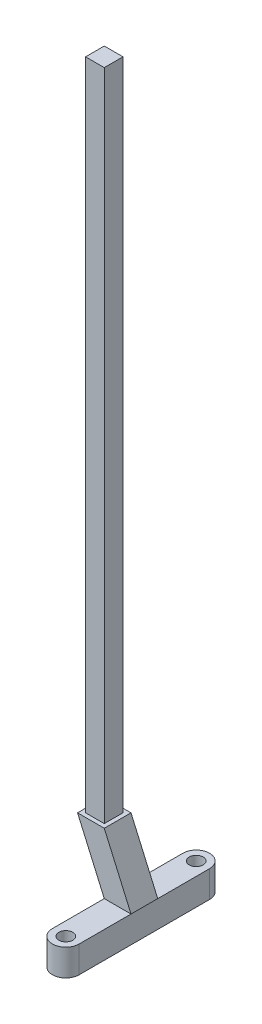
ISO-10303-21;
HEADER;
FILE_DESCRIPTION(('STEP AP214'),'2;1');
FILE_NAME('part.step','',(''),(''),'','','');
FILE_SCHEMA(('AUTOMOTIVE_DESIGN { 1 0 10303 214 1 1 1 1 }'));
ENDSEC;
DATA;
#1=APPLICATION_CONTEXT('core data for automotive mechanical design processes');
#2=APPLICATION_PROTOCOL_DEFINITION('international standard','automotive_design',2000,#1);
#3=PRODUCT_CONTEXT('',#1,'mechanical');
#4=PRODUCT('Part','Part','',(#3));
#5=PRODUCT_RELATED_PRODUCT_CATEGORY('part','',(#4));
#6=PRODUCT_DEFINITION_FORMATION('','',#4);
#7=PRODUCT_DEFINITION_CONTEXT('part definition',#1,'design');
#8=PRODUCT_DEFINITION('design','',#6,#7);
#9=PRODUCT_DEFINITION_SHAPE('','',#8);
#10=(LENGTH_UNIT() NAMED_UNIT(*) SI_UNIT(.MILLI.,.METRE.));
#11=(NAMED_UNIT(*) PLANE_ANGLE_UNIT() SI_UNIT($,.RADIAN.));
#12=(NAMED_UNIT(*) SI_UNIT($,.STERADIAN.) SOLID_ANGLE_UNIT());
#13=UNCERTAINTY_MEASURE_WITH_UNIT(LENGTH_MEASURE(1.E-05),#10,'distance_accuracy_value','');
#14=(GEOMETRIC_REPRESENTATION_CONTEXT(3) GLOBAL_UNCERTAINTY_ASSIGNED_CONTEXT((#13)) GLOBAL_UNIT_ASSIGNED_CONTEXT((#10,
#11,#12)) REPRESENTATION_CONTEXT('',''));
#15=CARTESIAN_POINT('',(0.,0.,0.));
#16=DIRECTION('',(0.,0.,1.));
#17=DIRECTION('',(1.,0.,0.));
#18=AXIS2_PLACEMENT_3D('',#15,#16,#17);
#19=CARTESIAN_POINT('',(0.,14.478,6.35));
#20=DIRECTION('',(0.,-1.,0.));
#21=DIRECTION('',(1.,0.,0.));
#22=AXIS2_PLACEMENT_3D('',#19,#20,#21);
#23=PLANE('',#22);
#24=DIRECTION('',(-1.,0.,0.));
#25=VECTOR('',#24,1.);
#26=CARTESIAN_POINT('',(0.,14.478,0.));
#27=LINE('',#26,#25);
#28=CARTESIAN_POINT('',(0.,14.478,0.));
#29=VERTEX_POINT('',#28);
#30=CARTESIAN_POINT('',(-6.35,14.478,0.));
#31=VERTEX_POINT('',#30);
#32=EDGE_CURVE('E226',#29,#31,#27,.T.);
#33=ORIENTED_EDGE('',*,*,#32,.T.);
#34=DIRECTION('',(0.,0.,-1.));
#35=VECTOR('',#34,1.);
#36=CARTESIAN_POINT('',(-6.35,14.478,6.35));
#37=LINE('',#36,#35);
#38=CARTESIAN_POINT('',(-6.35,14.478,6.35));
#39=VERTEX_POINT('',#38);
#40=EDGE_CURVE('E236',#39,#31,#37,.T.);
#41=ORIENTED_EDGE('',*,*,#40,.F.);
#42=DIRECTION('',(-1.,0.,0.));
#43=VECTOR('',#42,1.);
#44=CARTESIAN_POINT('',(0.,14.478,6.35));
#45=LINE('',#44,#43);
#46=CARTESIAN_POINT('',(0.,14.478,6.35));
#47=VERTEX_POINT('',#46);
#48=EDGE_CURVE('E233',#47,#39,#45,.T.);
#49=ORIENTED_EDGE('',*,*,#48,.F.);
#50=DIRECTION('',(0.,0.,-1.));
#51=VECTOR('',#50,1.);
#52=CARTESIAN_POINT('',(0.,14.478,6.35));
#53=LINE('',#52,#51);
#54=EDGE_CURVE('E251',#47,#29,#53,.T.);
#55=ORIENTED_EDGE('',*,*,#54,.T.);
#56=EDGE_LOOP('',(#33,#41,#49,#55));
#57=FACE_BOUND('',#56,.T.);
#58=DIRECTION('',(0.,0.,-1.));
#59=VECTOR('',#58,1.);
#60=CARTESIAN_POINT('',(-0.952500000000004,14.478,5.3975));
#61=LINE('',#60,#59);
#62=CARTESIAN_POINT('',(-0.952500000000004,14.478,5.3975));
#63=VERTEX_POINT('',#62);
#64=CARTESIAN_POINT('',(-0.952500000000004,14.478,0.9525));
#65=VERTEX_POINT('',#64);
#66=EDGE_CURVE('E55',#63,#65,#61,.T.);
#67=ORIENTED_EDGE('',*,*,#66,.F.);
#68=DIRECTION('',(1.,0.,0.));
#69=VECTOR('',#68,1.);
#70=CARTESIAN_POINT('',(-0.952500000000004,14.478,5.3975));
#71=LINE('',#70,#69);
#72=CARTESIAN_POINT('',(-5.3975,14.478,5.3975));
#73=VERTEX_POINT('',#72);
#74=EDGE_CURVE('E59',#73,#63,#71,.T.);
#75=ORIENTED_EDGE('',*,*,#74,.F.);
#76=DIRECTION('',(0.,0.,1.));
#77=VECTOR('',#76,1.);
#78=CARTESIAN_POINT('',(-5.3975,14.478,5.3975));
#79=LINE('',#78,#77);
#80=CARTESIAN_POINT('',(-5.3975,14.478,0.9525));
#81=VERTEX_POINT('',#80);
#82=EDGE_CURVE('E465',#81,#73,#79,.T.);
#83=ORIENTED_EDGE('',*,*,#82,.F.);
#84=DIRECTION('',(-1.,0.,0.));
#85=VECTOR('',#84,1.);
#86=CARTESIAN_POINT('',(-0.952500000000004,14.478,0.9525));
#87=LINE('',#86,#85);
#88=EDGE_CURVE('E475',#65,#81,#87,.T.);
#89=ORIENTED_EDGE('',*,*,#88,.F.);
#90=EDGE_LOOP('',(#67,#75,#83,#89));
#91=FACE_BOUND('',#90,.T.);
#92=ADVANCED_FACE('F39',(#57,#91),#23,.F.);
#93=CARTESIAN_POINT('',(-6.35,14.478,6.35));
#94=DIRECTION('',(0.915788208793949,0.401661495085065,0.));
#95=DIRECTION('',(-0.401661495085066,0.915788208793949,0.));
#96=AXIS2_PLACEMENT_3D('',#93,#94,#95);
#97=PLANE('',#96);
#98=DIRECTION('',(0.401661495085066,-0.915788208793949,0.));
#99=VECTOR('',#98,1.);
#100=CARTESIAN_POINT('',(-6.35,14.478,0.));
#101=LINE('',#100,#99);
#102=CARTESIAN_POINT('',(0.,0.,0.));
#103=VERTEX_POINT('',#102);
#104=EDGE_CURVE('E220',#31,#103,#101,.T.);
#105=ORIENTED_EDGE('',*,*,#104,.T.);
#106=DIRECTION('',(0.,0.,-1.));
#107=VECTOR('',#106,1.);
#108=CARTESIAN_POINT('',(0.,0.,6.35));
#109=LINE('',#108,#107);
#110=CARTESIAN_POINT('',(0.,0.,6.35));
#111=VERTEX_POINT('',#110);
#112=EDGE_CURVE('E11',#111,#103,#109,.T.);
#113=ORIENTED_EDGE('',*,*,#112,.F.);
#114=DIRECTION('',(0.401661495085066,-0.915788208793949,0.));
#115=VECTOR('',#114,1.);
#116=CARTESIAN_POINT('',(-6.35,14.478,6.35));
#117=LINE('',#116,#115);
#118=EDGE_CURVE('E221',#39,#111,#117,.T.);
#119=ORIENTED_EDGE('',*,*,#118,.F.);
#120=ORIENTED_EDGE('',*,*,#40,.T.);
#121=EDGE_LOOP('',(#105,#113,#119,#120));
#122=FACE_BOUND('',#121,.T.);
#123=ADVANCED_FACE('F41',(#122),#97,.F.);
#124=CARTESIAN_POINT('',(6.35,0.,6.35));
#125=DIRECTION('',(-0.915788208793949,-0.401661495085066,0.));
#126=DIRECTION('',(0.401661495085066,-0.915788208793949,0.));
#127=AXIS2_PLACEMENT_3D('',#124,#125,#126);
#128=PLANE('',#127);
#129=DIRECTION('',(-0.401661495085066,0.915788208793949,0.));
#130=VECTOR('',#129,1.);
#131=CARTESIAN_POINT('',(6.35,0.,0.));
#132=LINE('',#131,#130);
#133=CARTESIAN_POINT('',(6.35,0.,0.));
#134=VERTEX_POINT('',#133);
#135=EDGE_CURVE('E243',#134,#29,#132,.T.);
#136=ORIENTED_EDGE('',*,*,#135,.T.);
#137=ORIENTED_EDGE('',*,*,#54,.F.);
#138=DIRECTION('',(-0.401661495085066,0.915788208793949,0.));
#139=VECTOR('',#138,1.);
#140=CARTESIAN_POINT('',(6.35,0.,6.35));
#141=LINE('',#140,#139);
#142=CARTESIAN_POINT('',(6.35,0.,6.35));
#143=VERTEX_POINT('',#142);
#144=EDGE_CURVE('E230',#143,#47,#141,.T.);
#145=ORIENTED_EDGE('',*,*,#144,.F.);
#146=DIRECTION('',(0.,0.,-1.));
#147=VECTOR('',#146,1.);
#148=CARTESIAN_POINT('',(6.35,0.,6.35));
#149=LINE('',#148,#147);
#150=EDGE_CURVE('E48',#143,#134,#149,.T.);
#151=ORIENTED_EDGE('',*,*,#150,.T.);
#152=EDGE_LOOP('',(#136,#137,#145,#151));
#153=FACE_BOUND('',#152,.T.);
#154=ADVANCED_FACE('F259',(#153),#128,.F.);
#155=CARTESIAN_POINT('',(0.,0.,6.35));
#156=DIRECTION('',(0.,0.,1.));
#157=DIRECTION('',(1.,0.,0.));
#158=AXIS2_PLACEMENT_3D('',#155,#156,#157);
#159=PLANE('',#158);
#160=ORIENTED_EDGE('',*,*,#118,.T.);
#161=DIRECTION('',(1.,0.,0.));
#162=VECTOR('',#161,1.);
#163=CARTESIAN_POINT('',(0.,0.,6.35));
#164=LINE('',#163,#162);
#165=EDGE_CURVE('E225',#111,#143,#164,.T.);
#166=ORIENTED_EDGE('',*,*,#165,.T.);
#167=ORIENTED_EDGE('',*,*,#144,.T.);
#168=ORIENTED_EDGE('',*,*,#48,.T.);
#169=EDGE_LOOP('',(#160,#166,#167,#168));
#170=FACE_BOUND('',#169,.T.);
#171=ADVANCED_FACE('F275',(#170),#159,.T.);
#172=CARTESIAN_POINT('',(0.,0.,0.));
#173=DIRECTION('',(0.,0.,1.));
#174=DIRECTION('',(1.,0.,0.));
#175=AXIS2_PLACEMENT_3D('',#172,#173,#174);
#176=PLANE('',#175);
#177=ORIENTED_EDGE('',*,*,#104,.F.);
#178=ORIENTED_EDGE('',*,*,#32,.F.);
#179=ORIENTED_EDGE('',*,*,#135,.F.);
#180=DIRECTION('',(1.,0.,0.));
#181=VECTOR('',#180,1.);
#182=CARTESIAN_POINT('',(0.,0.,0.));
#183=LINE('',#182,#181);
#184=EDGE_CURVE('E240',#103,#134,#183,.T.);
#185=ORIENTED_EDGE('',*,*,#184,.F.);
#186=EDGE_LOOP('',(#177,#178,#179,#185));
#187=FACE_BOUND('',#186,.T.);
#188=ADVANCED_FACE('F267',(#187),#176,.F.);
#189=CARTESIAN_POINT('',(3.175,0.,18.669));
#190=DIRECTION('',(0.,-1.,0.));
#191=DIRECTION('',(1.,0.,0.));
#192=AXIS2_PLACEMENT_3D('',#189,#190,#191);
#193=PLANE('',#192);
#194=CARTESIAN_POINT('',(3.175,0.,-12.319));
#195=DIRECTION('',(0.,-1.,0.));
#196=DIRECTION('',(1.,0.,0.));
#197=AXIS2_PLACEMENT_3D('',#194,#195,#196);
#198=CIRCLE('',#197,1.651);
#199=CARTESIAN_POINT('',(4.826,0.,-12.319));
#200=VERTEX_POINT('',#199);
#201=EDGE_CURVE('E152',#200,#200,#198,.T.);
#202=ORIENTED_EDGE('',*,*,#201,.T.);
#203=EDGE_LOOP('',(#202));
#204=FACE_BOUND('',#203,.T.);
#205=DIRECTION('',(0.,0.,-1.));
#206=VECTOR('',#205,1.);
#207=CARTESIAN_POINT('',(0.,0.,18.669));
#208=LINE('',#207,#206);
#209=CARTESIAN_POINT('',(0.,0.,-12.319));
#210=VERTEX_POINT('',#209);
#211=EDGE_CURVE('E193',#103,#210,#208,.T.);
#212=ORIENTED_EDGE('',*,*,#211,.F.);
#213=ORIENTED_EDGE('',*,*,#184,.T.);
#214=DIRECTION('',(0.,0.,1.));
#215=VECTOR('',#214,1.);
#216=CARTESIAN_POINT('',(6.35,0.,18.669));
#217=LINE('',#216,#215);
#218=CARTESIAN_POINT('',(6.35,0.,-12.319));
#219=VERTEX_POINT('',#218);
#220=EDGE_CURVE('E180',#219,#134,#217,.T.);
#221=ORIENTED_EDGE('',*,*,#220,.F.);
#222=CARTESIAN_POINT('',(3.175,0.,-12.319));
#223=DIRECTION('',(0.,-1.,0.));
#224=DIRECTION('',(1.,0.,0.));
#225=AXIS2_PLACEMENT_3D('',#222,#223,#224);
#226=CIRCLE('',#225,3.175);
#227=EDGE_CURVE('E198',#210,#219,#226,.T.);
#228=ORIENTED_EDGE('',*,*,#227,.F.);
#229=EDGE_LOOP('',(#212,#213,#221,#228));
#230=FACE_BOUND('',#229,.T.);
#231=ADVANCED_FACE('F299',(#204,#230),#193,.F.);
#232=CARTESIAN_POINT('',(3.175,-6.35,18.669));
#233=DIRECTION('',(0.,-1.,0.));
#234=DIRECTION('',(1.,0.,0.));
#235=AXIS2_PLACEMENT_3D('',#232,#233,#234);
#236=PLANE('',#235);
#237=CARTESIAN_POINT('',(3.175,-6.35,18.669));
#238=DIRECTION('',(0.,-1.,0.));
#239=DIRECTION('',(1.,0.,0.));
#240=AXIS2_PLACEMENT_3D('',#237,#238,#239);
#241=CIRCLE('',#240,1.651);
#242=CARTESIAN_POINT('',(4.826,-6.35,18.669));
#243=VERTEX_POINT('',#242);
#244=EDGE_CURVE('E167',#243,#243,#241,.T.);
#245=ORIENTED_EDGE('',*,*,#244,.F.);
#246=EDGE_LOOP('',(#245));
#247=FACE_BOUND('',#246,.T.);
#248=CARTESIAN_POINT('',(3.175,-6.35,18.669));
#249=DIRECTION('',(0.,-1.,0.));
#250=DIRECTION('',(1.,0.,0.));
#251=AXIS2_PLACEMENT_3D('',#248,#249,#250);
#252=CIRCLE('',#251,3.175);
#253=CARTESIAN_POINT('',(6.35,-6.35,18.669));
#254=VERTEX_POINT('',#253);
#255=CARTESIAN_POINT('',(0.,-6.35,18.669));
#256=VERTEX_POINT('',#255);
#257=EDGE_CURVE('E175',#254,#256,#252,.T.);
#258=ORIENTED_EDGE('',*,*,#257,.T.);
#259=DIRECTION('',(0.,0.,-1.));
#260=VECTOR('',#259,1.);
#261=CARTESIAN_POINT('',(0.,-6.35,18.669));
#262=LINE('',#261,#260);
#263=CARTESIAN_POINT('',(0.,-6.35,-12.319));
#264=VERTEX_POINT('',#263);
#265=EDGE_CURVE('E179',#256,#264,#262,.T.);
#266=ORIENTED_EDGE('',*,*,#265,.T.);
#267=CARTESIAN_POINT('',(3.175,-6.35,-12.319));
#268=DIRECTION('',(0.,-1.,0.));
#269=DIRECTION('',(1.,0.,0.));
#270=AXIS2_PLACEMENT_3D('',#267,#268,#269);
#271=CIRCLE('',#270,3.175);
#272=CARTESIAN_POINT('',(6.35,-6.35,-12.319));
#273=VERTEX_POINT('',#272);
#274=EDGE_CURVE('E183',#264,#273,#271,.T.);
#275=ORIENTED_EDGE('',*,*,#274,.T.);
#276=DIRECTION('',(0.,0.,1.));
#277=VECTOR('',#276,1.);
#278=CARTESIAN_POINT('',(6.35,-6.35,18.669));
#279=LINE('',#278,#277);
#280=EDGE_CURVE('E186',#273,#254,#279,.T.);
#281=ORIENTED_EDGE('',*,*,#280,.T.);
#282=EDGE_LOOP('',(#258,#266,#275,#281));
#283=FACE_BOUND('',#282,.T.);
#284=CARTESIAN_POINT('',(3.175,-6.35,-12.319));
#285=DIRECTION('',(0.,-1.,0.));
#286=DIRECTION('',(1.,0.,0.));
#287=AXIS2_PLACEMENT_3D('',#284,#285,#286);
#288=CIRCLE('',#287,1.651);
#289=CARTESIAN_POINT('',(4.826,-6.35,-12.319));
#290=VERTEX_POINT('',#289);
#291=EDGE_CURVE('E157',#290,#290,#288,.T.);
#292=ORIENTED_EDGE('',*,*,#291,.F.);
#293=EDGE_LOOP('',(#292));
#294=FACE_BOUND('',#293,.T.);
#295=ADVANCED_FACE('F301',(#247,#283,#294),#236,.T.);
#296=ORIENTED_EDGE('',*,*,#165,.F.);
#297=CARTESIAN_POINT('',(0.,0.,18.669));
#298=VERTEX_POINT('',#297);
#299=EDGE_CURVE('E194',#298,#111,#208,.T.);
#300=ORIENTED_EDGE('',*,*,#299,.F.);
#301=CARTESIAN_POINT('',(3.175,0.,18.669));
#302=DIRECTION('',(0.,-1.,0.));
#303=DIRECTION('',(1.,0.,0.));
#304=AXIS2_PLACEMENT_3D('',#301,#302,#303);
#305=CIRCLE('',#304,3.175);
#306=CARTESIAN_POINT('',(6.35,0.,18.669));
#307=VERTEX_POINT('',#306);
#308=EDGE_CURVE('E171',#307,#298,#305,.T.);
#309=ORIENTED_EDGE('',*,*,#308,.F.);
#310=EDGE_CURVE('E201',#143,#307,#217,.T.);
#311=ORIENTED_EDGE('',*,*,#310,.F.);
#312=EDGE_LOOP('',(#296,#300,#309,#311));
#313=FACE_BOUND('',#312,.T.);
#314=CARTESIAN_POINT('',(3.175,0.,18.669));
#315=DIRECTION('',(0.,-1.,0.));
#316=DIRECTION('',(1.,0.,0.));
#317=AXIS2_PLACEMENT_3D('',#314,#315,#316);
#318=CIRCLE('',#317,1.651);
#319=CARTESIAN_POINT('',(4.826,0.,18.669));
#320=VERTEX_POINT('',#319);
#321=EDGE_CURVE('E165',#320,#320,#318,.T.);
#322=ORIENTED_EDGE('',*,*,#321,.T.);
#323=EDGE_LOOP('',(#322));
#324=FACE_BOUND('',#323,.T.);
#325=ADVANCED_FACE('F277',(#313,#324),#193,.F.);
#326=CARTESIAN_POINT('',(3.175,-6.35,18.669));
#327=DIRECTION('',(0.,1.,0.));
#328=DIRECTION('',(-1.,0.,0.));
#329=AXIS2_PLACEMENT_3D('',#326,#327,#328);
#330=CYLINDRICAL_SURFACE('',#329,3.175);
#331=ORIENTED_EDGE('',*,*,#308,.T.);
#332=DIRECTION('',(0.,1.,0.));
#333=VECTOR('',#332,1.);
#334=CARTESIAN_POINT('',(0.,-6.35,18.669));
#335=LINE('',#334,#333);
#336=EDGE_CURVE('E216',#256,#298,#335,.T.);
#337=ORIENTED_EDGE('',*,*,#336,.F.);
#338=ORIENTED_EDGE('',*,*,#257,.F.);
#339=DIRECTION('',(0.,1.,0.));
#340=VECTOR('',#339,1.);
#341=CARTESIAN_POINT('',(6.35,-6.35,18.669));
#342=LINE('',#341,#340);
#343=EDGE_CURVE('E189',#254,#307,#342,.T.);
#344=ORIENTED_EDGE('',*,*,#343,.T.);
#345=EDGE_LOOP('',(#331,#337,#338,#344));
#346=FACE_BOUND('',#345,.T.);
#347=ADVANCED_FACE('F286',(#346),#330,.T.);
#348=CARTESIAN_POINT('',(0.,-6.35,18.669));
#349=DIRECTION('',(1.,0.,0.));
#350=DIRECTION('',(0.,1.,0.));
#351=AXIS2_PLACEMENT_3D('',#348,#349,#350);
#352=PLANE('',#351);
#353=ORIENTED_EDGE('',*,*,#299,.T.);
#354=ORIENTED_EDGE('',*,*,#112,.T.);
#355=ORIENTED_EDGE('',*,*,#211,.T.);
#356=DIRECTION('',(0.,1.,0.));
#357=VECTOR('',#356,1.);
#358=CARTESIAN_POINT('',(0.,-6.35,-12.319));
#359=LINE('',#358,#357);
#360=EDGE_CURVE('E212',#264,#210,#359,.T.);
#361=ORIENTED_EDGE('',*,*,#360,.F.);
#362=ORIENTED_EDGE('',*,*,#265,.F.);
#363=ORIENTED_EDGE('',*,*,#336,.T.);
#364=EDGE_LOOP('',(#353,#354,#355,#361,#362,#363));
#365=FACE_BOUND('',#364,.T.);
#366=ADVANCED_FACE('F281',(#365),#352,.F.);
#367=CARTESIAN_POINT('',(3.175,-6.35,-12.319));
#368=DIRECTION('',(0.,1.,0.));
#369=DIRECTION('',(-1.,0.,0.));
#370=AXIS2_PLACEMENT_3D('',#367,#368,#369);
#371=CYLINDRICAL_SURFACE('',#370,3.175);
#372=ORIENTED_EDGE('',*,*,#227,.T.);
#373=DIRECTION('',(0.,1.,0.));
#374=VECTOR('',#373,1.);
#375=CARTESIAN_POINT('',(6.35,-6.35,-12.319));
#376=LINE('',#375,#374);
#377=EDGE_CURVE('E208',#273,#219,#376,.T.);
#378=ORIENTED_EDGE('',*,*,#377,.F.);
#379=ORIENTED_EDGE('',*,*,#274,.F.);
#380=ORIENTED_EDGE('',*,*,#360,.T.);
#381=EDGE_LOOP('',(#372,#378,#379,#380));
#382=FACE_BOUND('',#381,.T.);
#383=ADVANCED_FACE('F296',(#382),#371,.T.);
#384=CARTESIAN_POINT('',(6.35,-6.35,18.669));
#385=DIRECTION('',(-1.,0.,0.));
#386=DIRECTION('',(0.,-1.,0.));
#387=AXIS2_PLACEMENT_3D('',#384,#385,#386);
#388=PLANE('',#387);
#389=ORIENTED_EDGE('',*,*,#220,.T.);
#390=ORIENTED_EDGE('',*,*,#150,.F.);
#391=ORIENTED_EDGE('',*,*,#310,.T.);
#392=ORIENTED_EDGE('',*,*,#343,.F.);
#393=ORIENTED_EDGE('',*,*,#280,.F.);
#394=ORIENTED_EDGE('',*,*,#377,.T.);
#395=EDGE_LOOP('',(#389,#390,#391,#392,#393,#394));
#396=FACE_BOUND('',#395,.T.);
#397=ADVANCED_FACE('F289',(#396),#388,.F.);
#398=CARTESIAN_POINT('',(3.175,-6.35,18.669));
#399=DIRECTION('',(0.,1.,0.));
#400=DIRECTION('',(-1.,0.,0.));
#401=AXIS2_PLACEMENT_3D('',#398,#399,#400);
#402=CYLINDRICAL_SURFACE('',#401,1.651);
#403=ORIENTED_EDGE('',*,*,#244,.T.);
#404=EDGE_LOOP('',(#403));
#405=FACE_BOUND('',#404,.T.);
#406=ORIENTED_EDGE('',*,*,#321,.F.);
#407=EDGE_LOOP('',(#406));
#408=FACE_BOUND('',#407,.T.);
#409=ADVANCED_FACE('F332',(#405,#408),#402,.F.);
#410=CARTESIAN_POINT('',(3.175,-6.35,-12.319));
#411=DIRECTION('',(0.,1.,0.));
#412=DIRECTION('',(-1.,0.,0.));
#413=AXIS2_PLACEMENT_3D('',#410,#411,#412);
#414=CYLINDRICAL_SURFACE('',#413,1.651);
#415=ORIENTED_EDGE('',*,*,#291,.T.);
#416=EDGE_LOOP('',(#415));
#417=FACE_BOUND('',#416,.T.);
#418=ORIENTED_EDGE('',*,*,#201,.F.);
#419=EDGE_LOOP('',(#418));
#420=FACE_BOUND('',#419,.T.);
#421=ADVANCED_FACE('F336',(#417,#420),#414,.F.);
#422=CARTESIAN_POINT('',(-0.952499999999962,170.053,5.3975));
#423=DIRECTION('',(-1.,0.,0.));
#424=DIRECTION('',(0.,-1.,0.));
#425=AXIS2_PLACEMENT_3D('',#422,#423,#424);
#426=PLANE('',#425);
#427=ORIENTED_EDGE('',*,*,#66,.T.);
#428=DIRECTION('',(0.,-1.,0.));
#429=VECTOR('',#428,1.);
#430=CARTESIAN_POINT('',(-0.952499999999962,170.053,0.9525));
#431=LINE('',#430,#429);
#432=CARTESIAN_POINT('',(-0.952499999999962,170.053,0.9525));
#433=VERTEX_POINT('',#432);
#434=EDGE_CURVE('E132',#433,#65,#431,.T.);
#435=ORIENTED_EDGE('',*,*,#434,.F.);
#436=DIRECTION('',(0.,0.,-1.));
#437=VECTOR('',#436,1.);
#438=CARTESIAN_POINT('',(-0.952499999999962,170.053,5.3975));
#439=LINE('',#438,#437);
#440=CARTESIAN_POINT('',(-0.952499999999962,170.053,5.3975));
#441=VERTEX_POINT('',#440);
#442=EDGE_CURVE('E139',#441,#433,#439,.T.);
#443=ORIENTED_EDGE('',*,*,#442,.F.);
#444=DIRECTION('',(0.,-1.,0.));
#445=VECTOR('',#444,1.);
#446=CARTESIAN_POINT('',(-0.952499999999962,170.053,5.3975));
#447=LINE('',#446,#445);
#448=EDGE_CURVE('E462',#441,#63,#447,.T.);
#449=ORIENTED_EDGE('',*,*,#448,.T.);
#450=EDGE_LOOP('',(#427,#435,#443,#449));
#451=FACE_BOUND('',#450,.T.);
#452=ADVANCED_FACE('F150',(#451),#426,.F.);
#453=CARTESIAN_POINT('',(-0.952499999999962,170.053,0.9525));
#454=DIRECTION('',(0.,0.,1.));
#455=DIRECTION('',(1.,0.,0.));
#456=AXIS2_PLACEMENT_3D('',#453,#454,#455);
#457=PLANE('',#456);
#458=ORIENTED_EDGE('',*,*,#88,.T.);
#459=DIRECTION('',(0.,-1.,0.));
#460=VECTOR('',#459,1.);
#461=CARTESIAN_POINT('',(-5.39749999999996,170.053,0.9525));
#462=LINE('',#461,#460);
#463=CARTESIAN_POINT('',(-5.39749999999996,170.053,0.9525));
#464=VERTEX_POINT('',#463);
#465=EDGE_CURVE('E134',#464,#81,#462,.T.);
#466=ORIENTED_EDGE('',*,*,#465,.F.);
#467=DIRECTION('',(-1.,0.,0.));
#468=VECTOR('',#467,1.);
#469=CARTESIAN_POINT('',(-0.952499999999962,170.053,0.9525));
#470=LINE('',#469,#468);
#471=EDGE_CURVE('E127',#433,#464,#470,.T.);
#472=ORIENTED_EDGE('',*,*,#471,.F.);
#473=ORIENTED_EDGE('',*,*,#434,.T.);
#474=EDGE_LOOP('',(#458,#466,#472,#473));
#475=FACE_BOUND('',#474,.T.);
#476=ADVANCED_FACE('F130',(#475),#457,.F.);
#477=CARTESIAN_POINT('',(-5.39749999999996,170.053,5.3975));
#478=DIRECTION('',(1.,0.,0.));
#479=DIRECTION('',(0.,1.,0.));
#480=AXIS2_PLACEMENT_3D('',#477,#478,#479);
#481=PLANE('',#480);
#482=ORIENTED_EDGE('',*,*,#82,.T.);
#483=DIRECTION('',(0.,-1.,0.));
#484=VECTOR('',#483,1.);
#485=CARTESIAN_POINT('',(-5.39749999999996,170.053,5.3975));
#486=LINE('',#485,#484);
#487=CARTESIAN_POINT('',(-5.39749999999996,170.053,5.3975));
#488=VERTEX_POINT('',#487);
#489=EDGE_CURVE('E159',#488,#73,#486,.T.);
#490=ORIENTED_EDGE('',*,*,#489,.F.);
#491=DIRECTION('',(0.,0.,1.));
#492=VECTOR('',#491,1.);
#493=CARTESIAN_POINT('',(-5.39749999999996,170.053,5.3975));
#494=LINE('',#493,#492);
#495=EDGE_CURVE('E138',#464,#488,#494,.T.);
#496=ORIENTED_EDGE('',*,*,#495,.F.);
#497=ORIENTED_EDGE('',*,*,#465,.T.);
#498=EDGE_LOOP('',(#482,#490,#496,#497));
#499=FACE_BOUND('',#498,.T.);
#500=ADVANCED_FACE('F350',(#499),#481,.F.);
#501=CARTESIAN_POINT('',(-0.952499999999962,170.053,5.3975));
#502=DIRECTION('',(0.,0.,-1.));
#503=DIRECTION('',(-1.,0.,0.));
#504=AXIS2_PLACEMENT_3D('',#501,#502,#503);
#505=PLANE('',#504);
#506=ORIENTED_EDGE('',*,*,#74,.T.);
#507=ORIENTED_EDGE('',*,*,#448,.F.);
#508=DIRECTION('',(1.,0.,0.));
#509=VECTOR('',#508,1.);
#510=CARTESIAN_POINT('',(-0.952499999999962,170.053,5.3975));
#511=LINE('',#510,#509);
#512=EDGE_CURVE('E144',#488,#441,#511,.T.);
#513=ORIENTED_EDGE('',*,*,#512,.F.);
#514=ORIENTED_EDGE('',*,*,#489,.T.);
#515=EDGE_LOOP('',(#506,#507,#513,#514));
#516=FACE_BOUND('',#515,.T.);
#517=ADVANCED_FACE('F353',(#516),#505,.F.);
#518=CARTESIAN_POINT('',(0.,170.053,0.));
#519=DIRECTION('',(0.,1.,0.));
#520=DIRECTION('',(-1.,0.,0.));
#521=AXIS2_PLACEMENT_3D('',#518,#519,#520);
#522=PLANE('',#521);
#523=ORIENTED_EDGE('',*,*,#442,.T.);
#524=ORIENTED_EDGE('',*,*,#471,.T.);
#525=ORIENTED_EDGE('',*,*,#495,.T.);
#526=ORIENTED_EDGE('',*,*,#512,.T.);
#527=EDGE_LOOP('',(#523,#524,#525,#526));
#528=FACE_BOUND('',#527,.T.);
#529=ADVANCED_FACE('F142',(#528),#522,.T.);
#530=CLOSED_SHELL('',(#92,#123,#154,#171,#188,#231,#295,#325,#347,#366,#383,#397,#409,#421,#452,
#476,#500,#517,#529));
#531=MANIFOLD_SOLID_BREP('B2',#530);
#532=ADVANCED_BREP_SHAPE_REPRESENTATION('',(#18,#531),#14);
#533=SHAPE_DEFINITION_REPRESENTATION(#9,#532);
ENDSEC;
END-ISO-10303-21;
